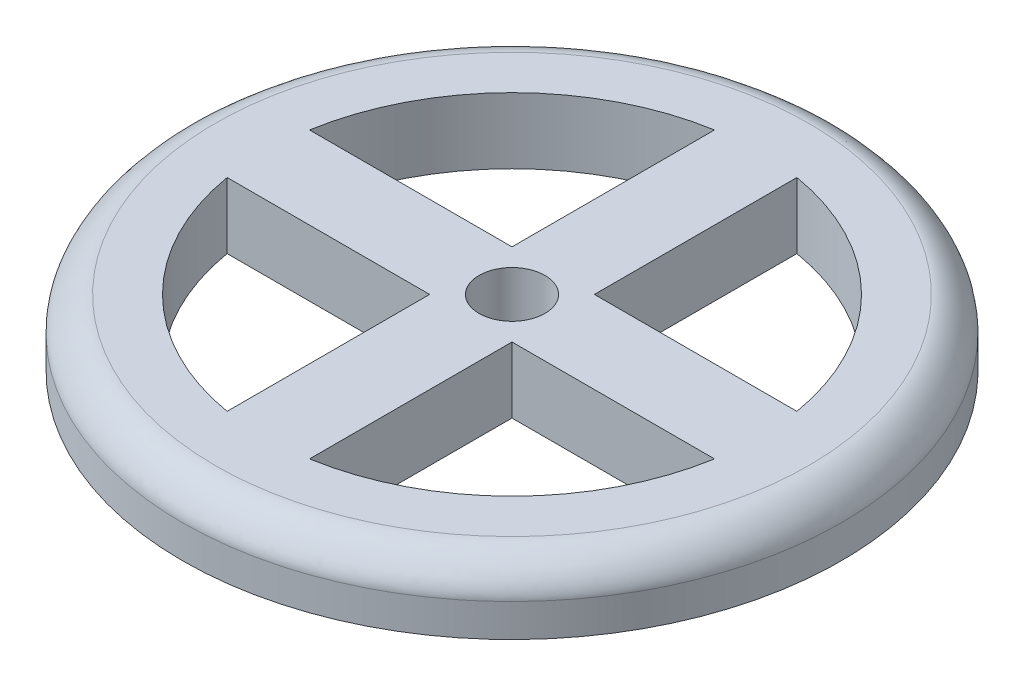
ISO-10303-21;
HEADER;
FILE_DESCRIPTION(('STEP AP214'),'2;1');
FILE_NAME('part.step','',(''),(''),'','','');
FILE_SCHEMA(('AUTOMOTIVE_DESIGN { 1 0 10303 214 1 1 1 1 }'));
ENDSEC;
DATA;
#1=APPLICATION_CONTEXT('core data for automotive mechanical design processes');
#2=APPLICATION_PROTOCOL_DEFINITION('international standard','automotive_design',2000,#1);
#3=PRODUCT_CONTEXT('',#1,'mechanical');
#4=PRODUCT('Part','Part','',(#3));
#5=PRODUCT_RELATED_PRODUCT_CATEGORY('part','',(#4));
#6=PRODUCT_DEFINITION_FORMATION('','',#4);
#7=PRODUCT_DEFINITION_CONTEXT('part definition',#1,'design');
#8=PRODUCT_DEFINITION('design','',#6,#7);
#9=PRODUCT_DEFINITION_SHAPE('','',#8);
#10=(LENGTH_UNIT() NAMED_UNIT(*) SI_UNIT(.MILLI.,.METRE.));
#11=(NAMED_UNIT(*) PLANE_ANGLE_UNIT() SI_UNIT($,.RADIAN.));
#12=(NAMED_UNIT(*) SI_UNIT($,.STERADIAN.) SOLID_ANGLE_UNIT());
#13=UNCERTAINTY_MEASURE_WITH_UNIT(LENGTH_MEASURE(1.E-05),#10,'distance_accuracy_value','');
#14=(GEOMETRIC_REPRESENTATION_CONTEXT(3) GLOBAL_UNCERTAINTY_ASSIGNED_CONTEXT((#13)) GLOBAL_UNIT_ASSIGNED_CONTEXT((#10,
#11,#12)) REPRESENTATION_CONTEXT('',''));
#15=CARTESIAN_POINT('',(0.,0.,0.));
#16=DIRECTION('',(0.,0.,1.));
#17=DIRECTION('',(1.,0.,0.));
#18=AXIS2_PLACEMENT_3D('',#15,#16,#17);
#19=CARTESIAN_POINT('',(-2.5,4.,0.));
#20=DIRECTION('',(1.,0.,0.));
#21=DIRECTION('',(0.,0.,-1.));
#22=AXIS2_PLACEMENT_3D('',#19,#20,#21);
#23=PLANE('',#22);
#24=DIRECTION('',(0.,0.,1.));
#25=VECTOR('',#24,1.);
#26=CARTESIAN_POINT('',(-2.5,0.,0.));
#27=LINE('',#26,#25);
#28=CARTESIAN_POINT('',(-2.5,0.,-14.790199457749));
#29=VERTEX_POINT('',#28);
#30=CARTESIAN_POINT('',(-2.5,0.,-2.5));
#31=VERTEX_POINT('',#30);
#32=EDGE_CURVE('E160',#29,#31,#27,.T.);
#33=ORIENTED_EDGE('',*,*,#32,.T.);
#34=DIRECTION('',(0.,-1.,0.));
#35=VECTOR('',#34,1.);
#36=CARTESIAN_POINT('',(-2.5,4.,-2.5));
#37=LINE('',#36,#35);
#38=CARTESIAN_POINT('',(-2.5,4.,-2.5));
#39=VERTEX_POINT('',#38);
#40=EDGE_CURVE('E159',#39,#31,#37,.T.);
#41=ORIENTED_EDGE('',*,*,#40,.F.);
#42=DIRECTION('',(0.,0.,1.));
#43=VECTOR('',#42,1.);
#44=CARTESIAN_POINT('',(-2.5,4.,0.));
#45=LINE('',#44,#43);
#46=CARTESIAN_POINT('',(-2.5,4.,-14.790199457749));
#47=VERTEX_POINT('',#46);
#48=EDGE_CURVE('E149',#47,#39,#45,.T.);
#49=ORIENTED_EDGE('',*,*,#48,.F.);
#50=DIRECTION('',(0.,-1.,0.));
#51=VECTOR('',#50,1.);
#52=CARTESIAN_POINT('',(-2.5,4.,-14.790199457749));
#53=LINE('',#52,#51);
#54=EDGE_CURVE('E70',#47,#29,#53,.T.);
#55=ORIENTED_EDGE('',*,*,#54,.T.);
#56=EDGE_LOOP('',(#33,#41,#49,#55));
#57=FACE_BOUND('',#56,.T.);
#58=ADVANCED_FACE('F46',(#57),#23,.F.);
#59=CARTESIAN_POINT('',(0.,4.,-2.5));
#60=DIRECTION('',(0.,0.,-1.));
#61=DIRECTION('',(-1.,0.,0.));
#62=AXIS2_PLACEMENT_3D('',#59,#60,#61);
#63=PLANE('',#62);
#64=DIRECTION('',(1.,0.,0.));
#65=VECTOR('',#64,1.);
#66=CARTESIAN_POINT('',(0.,0.,-2.5));
#67=LINE('',#66,#65);
#68=CARTESIAN_POINT('',(-14.790199457749,0.,-2.5));
#69=VERTEX_POINT('',#68);
#70=EDGE_CURVE('E211',#69,#31,#67,.T.);
#71=ORIENTED_EDGE('',*,*,#70,.F.);
#72=DIRECTION('',(0.,-1.,0.));
#73=VECTOR('',#72,1.);
#74=CARTESIAN_POINT('',(-14.790199457749,4.,-2.5));
#75=LINE('',#74,#73);
#76=CARTESIAN_POINT('',(-14.790199457749,4.,-2.5));
#77=VERTEX_POINT('',#76);
#78=EDGE_CURVE('E108',#77,#69,#75,.T.);
#79=ORIENTED_EDGE('',*,*,#78,.F.);
#80=DIRECTION('',(1.,0.,0.));
#81=VECTOR('',#80,1.);
#82=CARTESIAN_POINT('',(0.,4.,-2.5));
#83=LINE('',#82,#81);
#84=EDGE_CURVE('E154',#77,#39,#83,.T.);
#85=ORIENTED_EDGE('',*,*,#84,.T.);
#86=ORIENTED_EDGE('',*,*,#40,.T.);
#87=EDGE_LOOP('',(#71,#79,#85,#86));
#88=FACE_BOUND('',#87,.T.);
#89=ADVANCED_FACE('F165',(#88),#63,.T.);
#90=CARTESIAN_POINT('',(2.5,4.,0.));
#91=DIRECTION('',(1.,0.,0.));
#92=DIRECTION('',(0.,0.,-1.));
#93=AXIS2_PLACEMENT_3D('',#90,#91,#92);
#94=PLANE('',#93);
#95=DIRECTION('',(0.,0.,1.));
#96=VECTOR('',#95,1.);
#97=CARTESIAN_POINT('',(2.5,0.,0.));
#98=LINE('',#97,#96);
#99=CARTESIAN_POINT('',(2.5,0.,2.5));
#100=VERTEX_POINT('',#99);
#101=CARTESIAN_POINT('',(2.5,0.,14.790199457749));
#102=VERTEX_POINT('',#101);
#103=EDGE_CURVE('E200',#100,#102,#98,.T.);
#104=ORIENTED_EDGE('',*,*,#103,.F.);
#105=DIRECTION('',(0.,-1.,0.));
#106=VECTOR('',#105,1.);
#107=CARTESIAN_POINT('',(2.5,4.,2.5));
#108=LINE('',#107,#106);
#109=CARTESIAN_POINT('',(2.5,4.,2.5));
#110=VERTEX_POINT('',#109);
#111=EDGE_CURVE('E225',#110,#100,#108,.T.);
#112=ORIENTED_EDGE('',*,*,#111,.F.);
#113=DIRECTION('',(0.,0.,1.));
#114=VECTOR('',#113,1.);
#115=CARTESIAN_POINT('',(2.5,4.,0.));
#116=LINE('',#115,#114);
#117=CARTESIAN_POINT('',(2.5,4.,14.790199457749));
#118=VERTEX_POINT('',#117);
#119=EDGE_CURVE('E363',#110,#118,#116,.T.);
#120=ORIENTED_EDGE('',*,*,#119,.T.);
#121=DIRECTION('',(0.,-1.,0.));
#122=VECTOR('',#121,1.);
#123=CARTESIAN_POINT('',(2.5,4.,14.790199457749));
#124=LINE('',#123,#122);
#125=EDGE_CURVE('E228',#118,#102,#124,.T.);
#126=ORIENTED_EDGE('',*,*,#125,.T.);
#127=EDGE_LOOP('',(#104,#112,#120,#126));
#128=FACE_BOUND('',#127,.T.);
#129=ADVANCED_FACE('F320',(#128),#94,.T.);
#130=CARTESIAN_POINT('',(0.,4.,2.5));
#131=DIRECTION('',(0.,0.,-1.));
#132=DIRECTION('',(-1.,0.,0.));
#133=AXIS2_PLACEMENT_3D('',#130,#131,#132);
#134=PLANE('',#133);
#135=DIRECTION('',(1.,0.,0.));
#136=VECTOR('',#135,1.);
#137=CARTESIAN_POINT('',(0.,0.,2.5));
#138=LINE('',#137,#136);
#139=CARTESIAN_POINT('',(14.790199457749,0.,2.5));
#140=VERTEX_POINT('',#139);
#141=EDGE_CURVE('E204',#100,#140,#138,.T.);
#142=ORIENTED_EDGE('',*,*,#141,.T.);
#143=DIRECTION('',(0.,-1.,0.));
#144=VECTOR('',#143,1.);
#145=CARTESIAN_POINT('',(14.790199457749,4.,2.5));
#146=LINE('',#145,#144);
#147=CARTESIAN_POINT('',(14.790199457749,4.,2.5));
#148=VERTEX_POINT('',#147);
#149=EDGE_CURVE('E231',#148,#140,#146,.T.);
#150=ORIENTED_EDGE('',*,*,#149,.F.);
#151=DIRECTION('',(1.,0.,0.));
#152=VECTOR('',#151,1.);
#153=CARTESIAN_POINT('',(0.,4.,2.5));
#154=LINE('',#153,#152);
#155=EDGE_CURVE('E369',#110,#148,#154,.T.);
#156=ORIENTED_EDGE('',*,*,#155,.F.);
#157=ORIENTED_EDGE('',*,*,#111,.T.);
#158=EDGE_LOOP('',(#142,#150,#156,#157));
#159=FACE_BOUND('',#158,.T.);
#160=ADVANCED_FACE('F322',(#159),#134,.F.);
#161=CARTESIAN_POINT('',(0.,4.,-2.5));
#162=DIRECTION('',(0.,0.,-1.));
#163=DIRECTION('',(-1.,0.,0.));
#164=AXIS2_PLACEMENT_3D('',#161,#162,#163);
#165=PLANE('',#164);
#166=DIRECTION('',(1.,0.,0.));
#167=VECTOR('',#166,1.);
#168=CARTESIAN_POINT('',(0.,0.,-2.5));
#169=LINE('',#168,#167);
#170=CARTESIAN_POINT('',(2.5,0.,-2.5));
#171=VERTEX_POINT('',#170);
#172=CARTESIAN_POINT('',(14.790199457749,0.,-2.5));
#173=VERTEX_POINT('',#172);
#174=EDGE_CURVE('E190',#171,#173,#169,.T.);
#175=ORIENTED_EDGE('',*,*,#174,.F.);
#176=DIRECTION('',(0.,-1.,0.));
#177=VECTOR('',#176,1.);
#178=CARTESIAN_POINT('',(2.5,4.,-2.5));
#179=LINE('',#178,#177);
#180=CARTESIAN_POINT('',(2.5,4.,-2.5));
#181=VERTEX_POINT('',#180);
#182=EDGE_CURVE('E232',#181,#171,#179,.T.);
#183=ORIENTED_EDGE('',*,*,#182,.F.);
#184=DIRECTION('',(1.,0.,0.));
#185=VECTOR('',#184,1.);
#186=CARTESIAN_POINT('',(0.,4.,-2.5));
#187=LINE('',#186,#185);
#188=CARTESIAN_POINT('',(14.790199457749,4.,-2.5));
#189=VERTEX_POINT('',#188);
#190=EDGE_CURVE('E353',#181,#189,#187,.T.);
#191=ORIENTED_EDGE('',*,*,#190,.T.);
#192=DIRECTION('',(0.,-1.,0.));
#193=VECTOR('',#192,1.);
#194=CARTESIAN_POINT('',(14.790199457749,4.,-2.5));
#195=LINE('',#194,#193);
#196=EDGE_CURVE('E237',#189,#173,#195,.T.);
#197=ORIENTED_EDGE('',*,*,#196,.T.);
#198=EDGE_LOOP('',(#175,#183,#191,#197));
#199=FACE_BOUND('',#198,.T.);
#200=ADVANCED_FACE('F325',(#199),#165,.T.);
#201=CARTESIAN_POINT('',(2.5,4.,0.));
#202=DIRECTION('',(1.,0.,0.));
#203=DIRECTION('',(0.,0.,-1.));
#204=AXIS2_PLACEMENT_3D('',#201,#202,#203);
#205=PLANE('',#204);
#206=DIRECTION('',(0.,0.,1.));
#207=VECTOR('',#206,1.);
#208=CARTESIAN_POINT('',(2.5,0.,0.));
#209=LINE('',#208,#207);
#210=CARTESIAN_POINT('',(2.5,0.,-14.790199457749));
#211=VERTEX_POINT('',#210);
#212=EDGE_CURVE('E196',#211,#171,#209,.T.);
#213=ORIENTED_EDGE('',*,*,#212,.F.);
#214=DIRECTION('',(0.,-1.,0.));
#215=VECTOR('',#214,1.);
#216=CARTESIAN_POINT('',(2.5,4.,-14.790199457749));
#217=LINE('',#216,#215);
#218=CARTESIAN_POINT('',(2.5,4.,-14.790199457749));
#219=VERTEX_POINT('',#218);
#220=EDGE_CURVE('E240',#219,#211,#217,.T.);
#221=ORIENTED_EDGE('',*,*,#220,.F.);
#222=DIRECTION('',(0.,0.,1.));
#223=VECTOR('',#222,1.);
#224=CARTESIAN_POINT('',(2.5,4.,0.));
#225=LINE('',#224,#223);
#226=EDGE_CURVE('E358',#219,#181,#225,.T.);
#227=ORIENTED_EDGE('',*,*,#226,.T.);
#228=ORIENTED_EDGE('',*,*,#182,.T.);
#229=EDGE_LOOP('',(#213,#221,#227,#228));
#230=FACE_BOUND('',#229,.T.);
#231=ADVANCED_FACE('F330',(#230),#205,.T.);
#232=CARTESIAN_POINT('',(0.,4.,2.5));
#233=DIRECTION('',(0.,0.,-1.));
#234=DIRECTION('',(-1.,0.,0.));
#235=AXIS2_PLACEMENT_3D('',#232,#233,#234);
#236=PLANE('',#235);
#237=DIRECTION('',(1.,0.,0.));
#238=VECTOR('',#237,1.);
#239=CARTESIAN_POINT('',(0.,0.,2.5));
#240=LINE('',#239,#238);
#241=CARTESIAN_POINT('',(-14.790199457749,0.,2.5));
#242=VERTEX_POINT('',#241);
#243=CARTESIAN_POINT('',(-2.5,0.,2.5));
#244=VERTEX_POINT('',#243);
#245=EDGE_CURVE('E178',#242,#244,#240,.T.);
#246=ORIENTED_EDGE('',*,*,#245,.T.);
#247=DIRECTION('',(0.,-1.,0.));
#248=VECTOR('',#247,1.);
#249=CARTESIAN_POINT('',(-2.5,4.,2.5));
#250=LINE('',#249,#248);
#251=CARTESIAN_POINT('',(-2.5,4.,2.5));
#252=VERTEX_POINT('',#251);
#253=EDGE_CURVE('E241',#252,#244,#250,.T.);
#254=ORIENTED_EDGE('',*,*,#253,.F.);
#255=DIRECTION('',(1.,0.,0.));
#256=VECTOR('',#255,1.);
#257=CARTESIAN_POINT('',(0.,4.,2.5));
#258=LINE('',#257,#256);
#259=CARTESIAN_POINT('',(-14.790199457749,4.,2.5));
#260=VERTEX_POINT('',#259);
#261=EDGE_CURVE('E222',#260,#252,#258,.T.);
#262=ORIENTED_EDGE('',*,*,#261,.F.);
#263=DIRECTION('',(0.,-1.,0.));
#264=VECTOR('',#263,1.);
#265=CARTESIAN_POINT('',(-14.790199457749,4.,2.5));
#266=LINE('',#265,#264);
#267=EDGE_CURVE('E177',#260,#242,#266,.T.);
#268=ORIENTED_EDGE('',*,*,#267,.T.);
#269=EDGE_LOOP('',(#246,#254,#262,#268));
#270=FACE_BOUND('',#269,.T.);
#271=ADVANCED_FACE('F333',(#270),#236,.F.);
#272=CARTESIAN_POINT('',(-2.5,4.,0.));
#273=DIRECTION('',(1.,0.,0.));
#274=DIRECTION('',(0.,0.,-1.));
#275=AXIS2_PLACEMENT_3D('',#272,#273,#274);
#276=PLANE('',#275);
#277=DIRECTION('',(0.,0.,1.));
#278=VECTOR('',#277,1.);
#279=CARTESIAN_POINT('',(-2.5,0.,0.));
#280=LINE('',#279,#278);
#281=CARTESIAN_POINT('',(-2.5,0.,14.790199457749));
#282=VERTEX_POINT('',#281);
#283=EDGE_CURVE('E182',#244,#282,#280,.T.);
#284=ORIENTED_EDGE('',*,*,#283,.T.);
#285=DIRECTION('',(0.,-1.,0.));
#286=VECTOR('',#285,1.);
#287=CARTESIAN_POINT('',(-2.5,4.,14.790199457749));
#288=LINE('',#287,#286);
#289=CARTESIAN_POINT('',(-2.5,4.,14.790199457749));
#290=VERTEX_POINT('',#289);
#291=EDGE_CURVE('E248',#290,#282,#288,.T.);
#292=ORIENTED_EDGE('',*,*,#291,.F.);
#293=DIRECTION('',(0.,0.,1.));
#294=VECTOR('',#293,1.);
#295=CARTESIAN_POINT('',(-2.5,4.,0.));
#296=LINE('',#295,#294);
#297=EDGE_CURVE('E121',#252,#290,#296,.T.);
#298=ORIENTED_EDGE('',*,*,#297,.F.);
#299=ORIENTED_EDGE('',*,*,#253,.T.);
#300=EDGE_LOOP('',(#284,#292,#298,#299));
#301=FACE_BOUND('',#300,.T.);
#302=ADVANCED_FACE('F284',(#301),#276,.F.);
#303=CARTESIAN_POINT('',(0.,4.,0.));
#304=DIRECTION('',(0.,-1.,0.));
#305=DIRECTION('',(0.,0.,-1.));
#306=AXIS2_PLACEMENT_3D('',#303,#304,#305);
#307=CYLINDRICAL_SURFACE('',#306,20.);
#308=CARTESIAN_POINT('',(0.,2.,20.));
#309=CARTESIAN_POINT('',(1.30899693832957,2.,20.));
#310=CARTESIAN_POINT('',(2.61796151112264,2.,19.8710782422801));
#311=CARTESIAN_POINT('',(5.1856513695225,2.,19.3603329738491));
#312=CARTESIAN_POINT('',(6.44431316786531,2.,18.9785220915386));
#313=CARTESIAN_POINT('',(8.86302412673829,2.,17.9766592089129));
#314=CARTESIAN_POINT('',(10.0230134835804,2.,17.3566319800963));
#315=CARTESIAN_POINT('',(12.1997958372037,2.,15.9021525120055));
#316=CARTESIAN_POINT('',(13.2165350120906,2.,15.0677362353713));
#317=CARTESIAN_POINT('',(15.0677362353713,2.,13.2165350120906));
#318=CARTESIAN_POINT('',(15.9021525120058,2.,12.1997958372032));
#319=CARTESIAN_POINT('',(17.356631980096,2.,10.0230134835808));
#320=CARTESIAN_POINT('',(17.9766592089129,2.,8.86302412673833));
#321=CARTESIAN_POINT('',(18.9785220915386,2.,6.44431316786525));
#322=CARTESIAN_POINT('',(19.3603329738492,2.,5.18565136952208));
#323=CARTESIAN_POINT('',(19.87107824228,2.,2.61796151112308));
#324=CARTESIAN_POINT('',(20.,2.,1.3089969383224));
#325=CARTESIAN_POINT('',(20.,2.,-1.30899693832239));
#326=CARTESIAN_POINT('',(19.87107824228,2.,-2.6179615111233));
#327=CARTESIAN_POINT('',(19.3603329738492,2.,-5.1856513695218));
#328=CARTESIAN_POINT('',(18.9785220915382,2.,-6.44431316786614));
#329=CARTESIAN_POINT('',(17.9766592089133,2.,-8.86302412673747));
#330=CARTESIAN_POINT('',(17.3566319800964,2.,-10.0230134835803));
#331=CARTESIAN_POINT('',(15.9021525120055,2.,-12.1997958372038));
#332=CARTESIAN_POINT('',(15.0677362353716,2.,-13.2165350120903));
#333=CARTESIAN_POINT('',(13.2165350120902,2.,-15.0677362353717));
#334=CARTESIAN_POINT('',(12.1997958372047,2.,-15.9021525120048));
#335=CARTESIAN_POINT('',(10.0230134835794,2.,-17.356631980097));
#336=CARTESIAN_POINT('',(8.86302412673793,2.,-17.9766592089131));
#337=CARTESIAN_POINT('',(6.44431316786572,2.,-18.9785220915384));
#338=CARTESIAN_POINT('',(5.18565136952208,2.,-19.3603329738492));
#339=CARTESIAN_POINT('',(2.61796151112308,2.,-19.87107824228));
#340=CARTESIAN_POINT('',(1.3089969383224,2.,-20.));
#341=CARTESIAN_POINT('',(-1.30899693832239,2.,-20.));
#342=CARTESIAN_POINT('',(-2.61796151112281,2.,-19.8710782422801));
#343=CARTESIAN_POINT('',(-5.18565136952229,2.,-19.3603329738491));
#344=CARTESIAN_POINT('',(-6.44431316786566,2.,-18.9785220915384));
#345=CARTESIAN_POINT('',(-8.86302412673787,2.,-17.9766592089131));
#346=CARTESIAN_POINT('',(-10.0230134835794,2.,-17.356631980097));
#347=CARTESIAN_POINT('',(-12.1997958372047,2.,-15.9021525120048));
#348=CARTESIAN_POINT('',(-13.2165350120908,2.,-15.0677362353711));
#349=CARTESIAN_POINT('',(-15.0677362353711,2.,-13.2165350120908));
#350=CARTESIAN_POINT('',(-15.9021525120056,2.,-12.1997958372036));
#351=CARTESIAN_POINT('',(-17.3566319800962,2.,-10.0230134835806));
#352=CARTESIAN_POINT('',(-17.9766592089133,2.,-8.86302412673727));
#353=CARTESIAN_POINT('',(-18.9785220915381,2.,-6.44431316786638));
#354=CARTESIAN_POINT('',(-19.3603329738492,2.,-5.18565136952166));
#355=CARTESIAN_POINT('',(-19.87107824228,2.,-2.61796151112353));
#356=CARTESIAN_POINT('',(-20.,2.,-1.30899693832236));
#357=CARTESIAN_POINT('',(-20.,2.,1.30899693832243));
#358=CARTESIAN_POINT('',(-19.8710782422801,2.,2.61796151112285));
#359=CARTESIAN_POINT('',(-19.3603329738491,2.,5.18565136952225));
#360=CARTESIAN_POINT('',(-18.9785220915381,2.,6.44431316786632));
#361=CARTESIAN_POINT('',(-17.9766592089134,2.,8.86302412673721));
#362=CARTESIAN_POINT('',(-17.3566319800967,2.,10.0230134835798));
#363=CARTESIAN_POINT('',(-15.9021525120051,2.,12.1997958372042));
#364=CARTESIAN_POINT('',(-15.0677362353709,2.,13.216535012091));
#365=CARTESIAN_POINT('',(-13.2165350120911,2.,15.0677362353708));
#366=CARTESIAN_POINT('',(-12.199795837205,2.,15.9021525120047));
#367=CARTESIAN_POINT('',(-10.0230134835791,2.,17.3566319800971));
#368=CARTESIAN_POINT('',(-8.86302412673799,2.,17.976659208913));
#369=CARTESIAN_POINT('',(-6.44431316786566,2.,18.9785220915384));
#370=CARTESIAN_POINT('',(-5.18565136952176,2.,19.3603329738492));
#371=CARTESIAN_POINT('',(-2.61796151112343,2.,19.87107824228));
#372=CARTESIAN_POINT('',(-1.30899693832957,2.,20.));
#373=CARTESIAN_POINT('',(0.,2.,20.));
#374=(BOUNDED_CURVE() B_SPLINE_CURVE(3,(#308,#309,#310,#311,#312,#313,#314,#315,#316,#317,#318,
#319,#320,#321,#322,#323,#324,#325,#326,#327,#328,#329,#330,#331,#332,#333,#334,#335,#336,#337,
#338,#339,#340,#341,#342,#343,#344,#345,#346,#347,#348,#349,#350,#351,#352,#353,#354,#355,#356,
#357,#358,#359,#360,#361,#362,#363,#364,#365,#366,#367,#368,#369,#370,#371,#372,#373),
.UNSPECIFIED.,.T.,.F.) B_SPLINE_CURVE_WITH_KNOTS((4,2,2,2,2,2,2,2,2,2,2,2,2,2,2,2,2,2,2,2,2,2,2,
2,2,2,2,2,2,2,2,2,4),(0.,0.196349540849362,0.392699081698724,0.589048622548086,
0.785398163397448,0.98174770424681,1.17809724509617,1.37444678594553,1.5707963267949,
1.76714586764426,1.96349540849362,2.15984494934298,2.35619449019234,2.55254403104171,
2.74889357189107,2.94524311274043,3.14159265358979,3.33794219443916,3.53429173528852,
3.73064127613788,3.92699081698724,4.1233403578366,4.31968989868597,4.51603943953533,
4.71238898038469,4.90873852123405,5.10508806208341,5.30143760293278,5.49778714378214,
5.6941366846315,5.89048622548086,6.08683576633022,6.28318530717959),
.UNSPECIFIED.) CURVE() GEOMETRIC_REPRESENTATION_ITEM() RATIONAL_B_SPLINE_CURVE((1.,1.,1.,1.,1.,
1.,1.,1.,1.,1.,1.,1.,1.,1.,1.,1.,1.,1.,1.,1.,1.,1.,1.,1.,1.,1.,1.,1.,1.,1.,1.,1.,1.,1.,1.,1.,1.,
1.,1.,1.,1.,1.,1.,1.,1.,1.,1.,1.,1.,1.,1.,1.,1.,1.,1.,1.,1.,1.,1.,1.,1.,1.,1.,1.,1.,1.)) REPRESENTATION_ITEM(''));
#375=CARTESIAN_POINT('',(0.,2.,20.));
#376=VERTEX_POINT('',#375);
#377=EDGE_CURVE('E12',#376,#376,#374,.F.);
#378=ORIENTED_EDGE('',*,*,#377,.T.);
#379=EDGE_LOOP('',(#378));
#380=FACE_BOUND('',#379,.T.);
#381=CARTESIAN_POINT('',(0.,0.,0.));
#382=DIRECTION('',(0.,1.,0.));
#383=DIRECTION('',(0.,0.,1.));
#384=AXIS2_PLACEMENT_3D('',#381,#382,#383);
#385=CIRCLE('',#384,20.);
#386=CARTESIAN_POINT('',(0.,0.,20.));
#387=VERTEX_POINT('',#386);
#388=EDGE_CURVE('E214',#387,#387,#385,.T.);
#389=ORIENTED_EDGE('',*,*,#388,.T.);
#390=EDGE_LOOP('',(#389));
#391=FACE_BOUND('',#390,.T.);
#392=ADVANCED_FACE('F279',(#380,#391),#307,.T.);
#393=CARTESIAN_POINT('',(0.,4.,0.));
#394=DIRECTION('',(0.,-1.,0.));
#395=DIRECTION('',(0.,0.,-1.));
#396=AXIS2_PLACEMENT_3D('',#393,#394,#395);
#397=CYLINDRICAL_SURFACE('',#396,15.);
#398=CARTESIAN_POINT('',(0.,0.,0.));
#399=DIRECTION('',(0.,1.,0.));
#400=DIRECTION('',(0.,0.,1.));
#401=AXIS2_PLACEMENT_3D('',#398,#399,#400);
#402=CIRCLE('',#401,15.);
#403=EDGE_CURVE('E191',#29,#69,#402,.T.);
#404=ORIENTED_EDGE('',*,*,#403,.F.);
#405=ORIENTED_EDGE('',*,*,#54,.F.);
#406=CARTESIAN_POINT('',(0.,4.,0.));
#407=DIRECTION('',(0.,1.,0.));
#408=DIRECTION('',(0.,0.,1.));
#409=AXIS2_PLACEMENT_3D('',#406,#407,#408);
#410=CIRCLE('',#409,15.);
#411=EDGE_CURVE('E155',#47,#77,#410,.T.);
#412=ORIENTED_EDGE('',*,*,#411,.T.);
#413=ORIENTED_EDGE('',*,*,#78,.T.);
#414=EDGE_LOOP('',(#404,#405,#412,#413));
#415=FACE_BOUND('',#414,.T.);
#416=ADVANCED_FACE('F283',(#415),#397,.F.);
#417=EDGE_CURVE('E208',#102,#140,#402,.T.);
#418=ORIENTED_EDGE('',*,*,#417,.F.);
#419=ORIENTED_EDGE('',*,*,#125,.F.);
#420=EDGE_CURVE('E157',#118,#148,#410,.T.);
#421=ORIENTED_EDGE('',*,*,#420,.T.);
#422=ORIENTED_EDGE('',*,*,#149,.T.);
#423=EDGE_LOOP('',(#418,#419,#421,#422));
#424=FACE_BOUND('',#423,.T.);
#425=ADVANCED_FACE('F385',(#424),#397,.F.);
#426=EDGE_CURVE('E192',#173,#211,#402,.T.);
#427=ORIENTED_EDGE('',*,*,#426,.F.);
#428=ORIENTED_EDGE('',*,*,#196,.F.);
#429=EDGE_CURVE('E354',#189,#219,#410,.T.);
#430=ORIENTED_EDGE('',*,*,#429,.T.);
#431=ORIENTED_EDGE('',*,*,#220,.T.);
#432=EDGE_LOOP('',(#427,#428,#430,#431));
#433=FACE_BOUND('',#432,.T.);
#434=ADVANCED_FACE('F397',(#433),#397,.F.);
#435=EDGE_CURVE('E186',#242,#282,#402,.T.);
#436=ORIENTED_EDGE('',*,*,#435,.F.);
#437=ORIENTED_EDGE('',*,*,#267,.F.);
#438=EDGE_CURVE('E171',#260,#290,#410,.T.);
#439=ORIENTED_EDGE('',*,*,#438,.T.);
#440=ORIENTED_EDGE('',*,*,#291,.T.);
#441=EDGE_LOOP('',(#436,#437,#439,#440));
#442=FACE_BOUND('',#441,.T.);
#443=ADVANCED_FACE('F277',(#442),#397,.F.);
#444=CARTESIAN_POINT('',(0.,4.,0.));
#445=DIRECTION('',(0.,-1.,0.));
#446=DIRECTION('',(0.,0.,-1.));
#447=AXIS2_PLACEMENT_3D('',#444,#445,#446);
#448=CYLINDRICAL_SURFACE('',#447,2.);
#449=CARTESIAN_POINT('',(0.,4.,0.));
#450=DIRECTION('',(0.,1.,0.));
#451=DIRECTION('',(0.,0.,1.));
#452=AXIS2_PLACEMENT_3D('',#449,#450,#451);
#453=CIRCLE('',#452,2.);
#454=CARTESIAN_POINT('',(0.,4.,2.));
#455=VERTEX_POINT('',#454);
#456=EDGE_CURVE('E169',#455,#455,#453,.T.);
#457=ORIENTED_EDGE('',*,*,#456,.T.);
#458=EDGE_LOOP('',(#457));
#459=FACE_BOUND('',#458,.T.);
#460=CARTESIAN_POINT('',(0.,0.,0.));
#461=DIRECTION('',(0.,1.,0.));
#462=DIRECTION('',(0.,0.,1.));
#463=AXIS2_PLACEMENT_3D('',#460,#461,#462);
#464=CIRCLE('',#463,2.);
#465=CARTESIAN_POINT('',(0.,0.,2.));
#466=VERTEX_POINT('',#465);
#467=EDGE_CURVE('E218',#466,#466,#464,.T.);
#468=ORIENTED_EDGE('',*,*,#467,.F.);
#469=EDGE_LOOP('',(#468));
#470=FACE_BOUND('',#469,.T.);
#471=ADVANCED_FACE('F271',(#459,#470),#448,.F.);
#472=CARTESIAN_POINT('',(0.,4.,0.));
#473=DIRECTION('',(0.,1.,0.));
#474=DIRECTION('',(0.,0.,1.));
#475=AXIS2_PLACEMENT_3D('',#472,#473,#474);
#476=PLANE('',#475);
#477=CARTESIAN_POINT('',(0.,4.,18.));
#478=CARTESIAN_POINT('',(-1.17809724449661,4.,18.));
#479=CARTESIAN_POINT('',(-2.3561653600105,4.,17.8839704180491));
#480=CARTESIAN_POINT('',(-4.66708623257016,4.,17.4242996764672));
#481=CARTESIAN_POINT('',(-5.79988185107918,4.,17.0806698823861));
#482=CARTESIAN_POINT('',(-7.9767217140641,4.,16.1789932880202));
#483=CARTESIAN_POINT('',(-9.02071213522079,4.,15.6209687820875));
#484=CARTESIAN_POINT('',(-10.9798162534849,4.,14.3119372608041));
#485=CARTESIAN_POINT('',(-11.894881510882,4.,13.5609626118337));
#486=CARTESIAN_POINT('',(-13.5609626118338,4.,11.8948815108819));
#487=CARTESIAN_POINT('',(-14.3119372608041,4.,10.9798162534839));
#488=CARTESIAN_POINT('',(-15.6209687820875,4.,9.02071213522179));
#489=CARTESIAN_POINT('',(-16.1789932880222,4.,7.97672171406405));
#490=CARTESIAN_POINT('',(-17.0806698823841,4.,5.79988185107913));
#491=CARTESIAN_POINT('',(-17.4242996764651,4.,4.66708623256987));
#492=CARTESIAN_POINT('',(-17.8839704180512,4.,2.35616536001072));
#493=CARTESIAN_POINT('',(-18.,4.,1.17809724449019));
#494=CARTESIAN_POINT('',(-18.,4.,-1.17809724449013));
#495=CARTESIAN_POINT('',(-17.8839704180512,4.,-2.35616536001076));
#496=CARTESIAN_POINT('',(-17.4242996764651,4.,-4.66708623256991));
#497=CARTESIAN_POINT('',(-17.0806698823841,4.,-5.79988185107918));
#498=CARTESIAN_POINT('',(-16.1789932880222,4.,-7.9767217140641));
#499=CARTESIAN_POINT('',(-15.6209687820875,4.,-9.02071213522284));
#500=CARTESIAN_POINT('',(-14.3119372608041,4.,-10.9798162534829));
#501=CARTESIAN_POINT('',(-13.5609626118353,4.,-11.8948815108825));
#502=CARTESIAN_POINT('',(-11.8948815108804,4.,-13.5609626118332));
#503=CARTESIAN_POINT('',(-10.9798162534835,4.,-14.311937260804));
#504=CARTESIAN_POINT('',(-9.02071213522213,4.,-15.6209687820877));
#505=CARTESIAN_POINT('',(-7.97672171406407,4.,-16.1789932880207));
#506=CARTESIAN_POINT('',(-5.79988185107912,4.,-17.0806698823857));
#507=CARTESIAN_POINT('',(-4.66708623256991,4.,-17.4242996764653));
#508=CARTESIAN_POINT('',(-2.35616536001068,4.,-17.883970418051));
#509=CARTESIAN_POINT('',(-1.17809724449015,4.,-18.));
#510=CARTESIAN_POINT('',(1.17809724449016,4.,-18.));
#511=CARTESIAN_POINT('',(2.35616536001071,4.,-17.883970418053));
#512=CARTESIAN_POINT('',(4.66708623256993,4.,-17.4242996764633));
#513=CARTESIAN_POINT('',(5.79988185107917,4.,-17.0806698823856));
#514=CARTESIAN_POINT('',(7.97672171406412,4.,-16.1789932880207));
#515=CARTESIAN_POINT('',(9.02071213522215,4.,-15.6209687820876));
#516=CARTESIAN_POINT('',(10.9798162534836,4.,-14.311937260804));
#517=CARTESIAN_POINT('',(11.8948815108814,4.,-13.5609626118343));
#518=CARTESIAN_POINT('',(13.5609626118343,4.,-11.8948815108814));
#519=CARTESIAN_POINT('',(14.311937260805,4.,-10.9798162534835));
#520=CARTESIAN_POINT('',(15.6209687820866,4.,-9.02071213522213));
#521=CARTESIAN_POINT('',(16.1789932880227,4.,-7.97672171406359));
#522=CARTESIAN_POINT('',(17.0806698823836,4.,-5.79988185107966));
#523=CARTESIAN_POINT('',(17.4242996764653,4.,-4.66708623256965));
#524=CARTESIAN_POINT('',(17.883970418051,4.,-2.35616536001094));
#525=CARTESIAN_POINT('',(18.,4.,-1.17809724449015));
#526=CARTESIAN_POINT('',(18.,4.,1.17809724449016));
#527=CARTESIAN_POINT('',(17.883970418053,4.,2.35616536001096));
#528=CARTESIAN_POINT('',(17.4242996764633,4.,4.66708623256968));
#529=CARTESIAN_POINT('',(17.0806698823836,4.,5.79988185107913));
#530=CARTESIAN_POINT('',(16.1789932880227,4.,7.97672171406409));
#531=CARTESIAN_POINT('',(15.6209687820863,4.,9.02071213522308));
#532=CARTESIAN_POINT('',(14.3119372608053,4.,10.9798162534826));
#533=CARTESIAN_POINT('',(13.5609626118336,4.,11.8948815108811));
#534=CARTESIAN_POINT('',(11.8948815108821,4.,13.5609626118347));
#535=CARTESIAN_POINT('',(10.9798162534836,4.,14.3119372608053));
#536=CARTESIAN_POINT('',(9.02071213522206,4.,15.6209687820863));
#537=CARTESIAN_POINT('',(7.97672171406403,4.,16.1789932880211));
#538=CARTESIAN_POINT('',(5.79988185107921,4.,17.0806698823852));
#539=CARTESIAN_POINT('',(4.66708623256998,4.,17.4242996764636));
#540=CARTESIAN_POINT('',(2.35616536001064,4.,17.8839704180527));
#541=CARTESIAN_POINT('',(1.17809724449661,4.,18.));
#542=CARTESIAN_POINT('',(0.,4.,18.));
#543=(BOUNDED_CURVE() B_SPLINE_CURVE(3,(#477,#478,#479,#480,#481,#482,#483,#484,#485,#486,#487,
#488,#489,#490,#491,#492,#493,#494,#495,#496,#497,#498,#499,#500,#501,#502,#503,#504,#505,#506,
#507,#508,#509,#510,#511,#512,#513,#514,#515,#516,#517,#518,#519,#520,#521,#522,#523,#524,#525,
#526,#527,#528,#529,#530,#531,#532,#533,#534,#535,#536,#537,#538,#539,#540,#541,#542),
.UNSPECIFIED.,.T.,.F.) B_SPLINE_CURVE_WITH_KNOTS((4,2,2,2,2,2,2,2,2,2,2,2,2,2,2,2,2,2,2,2,2,2,2,
2,2,2,2,2,2,2,2,2,4),(0.,0.196349540849362,0.392699081698725,0.589048622548086,
0.785398163397448,0.981747704246811,1.17809724509617,1.37444678594553,1.5707963267949,
1.76714586764426,1.96349540849362,2.15984494934298,2.35619449019234,2.55254403104171,
2.74889357189107,2.94524311274043,3.14159265358979,3.33794219443916,3.53429173528852,
3.73064127613788,3.92699081698724,4.1233403578366,4.31968989868597,4.51603943953533,
4.71238898038469,4.90873852123405,5.10508806208341,5.30143760293278,5.49778714378214,
5.6941366846315,5.89048622548086,6.08683576633022,6.28318530717959),
.UNSPECIFIED.) CURVE() GEOMETRIC_REPRESENTATION_ITEM() RATIONAL_B_SPLINE_CURVE((1.,1.,1.,1.,1.,
1.,1.,1.,1.,1.,1.,1.,1.,1.,1.,1.,1.,1.,1.,1.,1.,1.,1.,1.,1.,1.,1.,1.,1.,1.,1.,1.,1.,1.,1.,1.,1.,
1.,1.,1.,1.,1.,1.,1.,1.,1.,1.,1.,1.,1.,1.,1.,1.,1.,1.,1.,1.,1.,1.,1.,1.,1.,1.,1.,1.,1.)) REPRESENTATION_ITEM(''));
#544=CARTESIAN_POINT('',(0.,4.,18.));
#545=VERTEX_POINT('',#544);
#546=EDGE_CURVE('E62',#545,#545,#543,.F.);
#547=ORIENTED_EDGE('',*,*,#546,.T.);
#548=EDGE_LOOP('',(#547));
#549=FACE_BOUND('',#548,.T.);
#550=ORIENTED_EDGE('',*,*,#261,.T.);
#551=ORIENTED_EDGE('',*,*,#297,.T.);
#552=ORIENTED_EDGE('',*,*,#438,.F.);
#553=EDGE_LOOP('',(#550,#551,#552));
#554=FACE_BOUND('',#553,.T.);
#555=ORIENTED_EDGE('',*,*,#190,.F.);
#556=ORIENTED_EDGE('',*,*,#226,.F.);
#557=ORIENTED_EDGE('',*,*,#429,.F.);
#558=EDGE_LOOP('',(#555,#556,#557));
#559=FACE_BOUND('',#558,.T.);
#560=ORIENTED_EDGE('',*,*,#119,.F.);
#561=ORIENTED_EDGE('',*,*,#155,.T.);
#562=ORIENTED_EDGE('',*,*,#420,.F.);
#563=EDGE_LOOP('',(#560,#561,#562));
#564=FACE_BOUND('',#563,.T.);
#565=ORIENTED_EDGE('',*,*,#48,.T.);
#566=ORIENTED_EDGE('',*,*,#84,.F.);
#567=ORIENTED_EDGE('',*,*,#411,.F.);
#568=EDGE_LOOP('',(#565,#566,#567));
#569=FACE_BOUND('',#568,.T.);
#570=ORIENTED_EDGE('',*,*,#456,.F.);
#571=EDGE_LOOP('',(#570));
#572=FACE_BOUND('',#571,.T.);
#573=ADVANCED_FACE('F151',(#549,#554,#559,#564,#569,#572),#476,.T.);
#574=CARTESIAN_POINT('',(0.,0.,0.));
#575=DIRECTION('',(0.,1.,0.));
#576=DIRECTION('',(0.,0.,1.));
#577=AXIS2_PLACEMENT_3D('',#574,#575,#576);
#578=PLANE('',#577);
#579=ORIENTED_EDGE('',*,*,#245,.F.);
#580=ORIENTED_EDGE('',*,*,#435,.T.);
#581=ORIENTED_EDGE('',*,*,#283,.F.);
#582=EDGE_LOOP('',(#579,#580,#581));
#583=FACE_BOUND('',#582,.T.);
#584=ORIENTED_EDGE('',*,*,#174,.T.);
#585=ORIENTED_EDGE('',*,*,#426,.T.);
#586=ORIENTED_EDGE('',*,*,#212,.T.);
#587=EDGE_LOOP('',(#584,#585,#586));
#588=FACE_BOUND('',#587,.T.);
#589=ORIENTED_EDGE('',*,*,#103,.T.);
#590=ORIENTED_EDGE('',*,*,#417,.T.);
#591=ORIENTED_EDGE('',*,*,#141,.F.);
#592=EDGE_LOOP('',(#589,#590,#591));
#593=FACE_BOUND('',#592,.T.);
#594=ORIENTED_EDGE('',*,*,#32,.F.);
#595=ORIENTED_EDGE('',*,*,#403,.T.);
#596=ORIENTED_EDGE('',*,*,#70,.T.);
#597=EDGE_LOOP('',(#594,#595,#596));
#598=FACE_BOUND('',#597,.T.);
#599=ORIENTED_EDGE('',*,*,#388,.F.);
#600=EDGE_LOOP('',(#599));
#601=FACE_BOUND('',#600,.T.);
#602=ORIENTED_EDGE('',*,*,#467,.T.);
#603=EDGE_LOOP('',(#602));
#604=FACE_BOUND('',#603,.T.);
#605=ADVANCED_FACE('F270',(#583,#588,#593,#598,#601,#604),#578,.F.);
#606=CARTESIAN_POINT('',(0.,4.,18.));
#607=CARTESIAN_POINT('',(1.17809724449661,4.,18.));
#608=CARTESIAN_POINT('',(2.35616536001064,4.,17.8839704180527));
#609=CARTESIAN_POINT('',(4.66708623256998,4.,17.4242996764636));
#610=CARTESIAN_POINT('',(5.79988185107921,4.,17.0806698823852));
#611=CARTESIAN_POINT('',(7.97672171406403,4.,16.1789932880211));
#612=CARTESIAN_POINT('',(9.02071213522206,4.,15.6209687820863));
#613=CARTESIAN_POINT('',(10.9798162534836,4.,14.3119372608053));
#614=CARTESIAN_POINT('',(11.8948815108821,4.,13.5609626118347));
#615=CARTESIAN_POINT('',(13.5609626118336,4.,11.8948815108811));
#616=CARTESIAN_POINT('',(14.3119372608053,4.,10.9798162534826));
#617=CARTESIAN_POINT('',(15.6209687820863,4.,9.02071213522308));
#618=CARTESIAN_POINT('',(16.1789932880227,4.,7.97672171406409));
#619=CARTESIAN_POINT('',(17.0806698823836,4.,5.79988185107913));
#620=CARTESIAN_POINT('',(17.4242996764633,4.,4.66708623256968));
#621=CARTESIAN_POINT('',(17.883970418053,4.,2.35616536001096));
#622=CARTESIAN_POINT('',(18.,4.,1.17809724449016));
#623=CARTESIAN_POINT('',(18.,4.,-1.17809724449015));
#624=CARTESIAN_POINT('',(17.883970418051,4.,-2.35616536001094));
#625=CARTESIAN_POINT('',(17.4242996764653,4.,-4.66708623256965));
#626=CARTESIAN_POINT('',(17.0806698823836,4.,-5.79988185107966));
#627=CARTESIAN_POINT('',(16.1789932880227,4.,-7.97672171406359));
#628=CARTESIAN_POINT('',(15.6209687820866,4.,-9.02071213522213));
#629=CARTESIAN_POINT('',(14.311937260805,4.,-10.9798162534835));
#630=CARTESIAN_POINT('',(13.5609626118343,4.,-11.8948815108814));
#631=CARTESIAN_POINT('',(11.8948815108814,4.,-13.5609626118343));
#632=CARTESIAN_POINT('',(10.9798162534836,4.,-14.311937260804));
#633=CARTESIAN_POINT('',(9.02071213522215,4.,-15.6209687820876));
#634=CARTESIAN_POINT('',(7.97672171406412,4.,-16.1789932880207));
#635=CARTESIAN_POINT('',(5.79988185107917,4.,-17.0806698823856));
#636=CARTESIAN_POINT('',(4.66708623256993,4.,-17.4242996764633));
#637=CARTESIAN_POINT('',(2.35616536001071,4.,-17.883970418053));
#638=CARTESIAN_POINT('',(1.17809724449016,4.,-18.));
#639=CARTESIAN_POINT('',(-1.17809724449015,4.,-18.));
#640=CARTESIAN_POINT('',(-2.35616536001068,4.,-17.883970418051));
#641=CARTESIAN_POINT('',(-4.66708623256991,4.,-17.4242996764653));
#642=CARTESIAN_POINT('',(-5.79988185107912,4.,-17.0806698823857));
#643=CARTESIAN_POINT('',(-7.97672171406407,4.,-16.1789932880207));
#644=CARTESIAN_POINT('',(-9.02071213522213,4.,-15.6209687820877));
#645=CARTESIAN_POINT('',(-10.9798162534835,4.,-14.311937260804));
#646=CARTESIAN_POINT('',(-11.8948815108804,4.,-13.5609626118332));
#647=CARTESIAN_POINT('',(-13.5609626118353,4.,-11.8948815108825));
#648=CARTESIAN_POINT('',(-14.3119372608041,4.,-10.9798162534829));
#649=CARTESIAN_POINT('',(-15.6209687820875,4.,-9.02071213522284));
#650=CARTESIAN_POINT('',(-16.1789932880222,4.,-7.9767217140641));
#651=CARTESIAN_POINT('',(-17.0806698823841,4.,-5.79988185107918));
#652=CARTESIAN_POINT('',(-17.4242996764651,4.,-4.66708623256991));
#653=CARTESIAN_POINT('',(-17.8839704180512,4.,-2.35616536001076));
#654=CARTESIAN_POINT('',(-18.,4.,-1.17809724449013));
#655=CARTESIAN_POINT('',(-18.,4.,1.17809724449019));
#656=CARTESIAN_POINT('',(-17.8839704180512,4.,2.35616536001072));
#657=CARTESIAN_POINT('',(-17.4242996764651,4.,4.66708623256987));
#658=CARTESIAN_POINT('',(-17.0806698823841,4.,5.79988185107913));
#659=CARTESIAN_POINT('',(-16.1789932880222,4.,7.97672171406405));
#660=CARTESIAN_POINT('',(-15.6209687820875,4.,9.02071213522179));
#661=CARTESIAN_POINT('',(-14.3119372608041,4.,10.9798162534839));
#662=CARTESIAN_POINT('',(-13.5609626118338,4.,11.8948815108819));
#663=CARTESIAN_POINT('',(-11.894881510882,4.,13.5609626118337));
#664=CARTESIAN_POINT('',(-10.9798162534849,4.,14.3119372608041));
#665=CARTESIAN_POINT('',(-9.02071213522079,4.,15.6209687820875));
#666=CARTESIAN_POINT('',(-7.9767217140641,4.,16.1789932880202));
#667=CARTESIAN_POINT('',(-5.79988185107918,4.,17.0806698823861));
#668=CARTESIAN_POINT('',(-4.66708623257016,4.,17.4242996764672));
#669=CARTESIAN_POINT('',(-2.3561653600105,4.,17.8839704180491));
#670=CARTESIAN_POINT('',(-1.17809724449661,4.,18.));
#671=CARTESIAN_POINT('',(0.,4.,18.));
#672=CARTESIAN_POINT('',(0.,4.,20.));
#673=CARTESIAN_POINT('',(1.30899693832957,3.99999999999898,20.));
#674=CARTESIAN_POINT('',(2.61796151112333,4.,19.8710782422823));
#675=CARTESIAN_POINT('',(5.1856513695218,4.,19.3603329738469));
#676=CARTESIAN_POINT('',(6.44431316786601,4.,18.9785220915403));
#677=CARTESIAN_POINT('',(8.86302412673759,4.,17.9766592089112));
#678=CARTESIAN_POINT('',(10.0230134835794,4.,17.3566319800948));
#679=CARTESIAN_POINT('',(12.1997958372047,4.,15.902152512007));
#680=CARTESIAN_POINT('',(13.2165350120911,4.,15.0677362353718));
#681=CARTESIAN_POINT('',(15.0677362353708,4.,13.2165350120901));
#682=CARTESIAN_POINT('',(15.902152512005,3.99999999999999,12.1997958372027));
#683=CARTESIAN_POINT('',(17.3566319800969,3.99999999999999,10.0230134835814));
#684=CARTESIAN_POINT('',(17.9766592089128,4.,8.86302412673827));
#685=CARTESIAN_POINT('',(18.9785220915387,4.,6.44431316786531));
#686=CARTESIAN_POINT('',(19.3603329738485,4.,5.18565136952195));
#687=CARTESIAN_POINT('',(19.8710782422807,4.,2.61796151112321));
#688=CARTESIAN_POINT('',(20.,4.,1.3089969383224));
#689=CARTESIAN_POINT('',(20.,4.,-1.30899693832239));
#690=CARTESIAN_POINT('',(19.8710782422807,4.,-2.61796151112344));
#691=CARTESIAN_POINT('',(19.3603329738485,4.,-5.18565136952167));
#692=CARTESIAN_POINT('',(18.9785220915387,4.,-6.44431316786634));
#693=CARTESIAN_POINT('',(17.9766592089128,4.,-8.86302412673726));
#694=CARTESIAN_POINT('',(17.3566319800963,4.,-10.0230134835803));
#695=CARTESIAN_POINT('',(15.9021525120056,4.,-12.1997958372038));
#696=CARTESIAN_POINT('',(15.0677362353716,3.99999999999795,-13.2165350120903));
#697=CARTESIAN_POINT('',(13.2165350120903,4.00000000000204,-15.0677362353717));
#698=CARTESIAN_POINT('',(12.1997958372038,3.99999999999898,-15.9021525120035));
#699=CARTESIAN_POINT('',(10.0230134835803,4.00000000000102,-17.3566319800983));
#700=CARTESIAN_POINT('',(8.86302412673779,4.,-17.9766592089128));
#701=CARTESIAN_POINT('',(6.44431316786585,4.,-18.9785220915387));
#702=CARTESIAN_POINT('',(5.18565136952221,4.,-19.3603329738485));
#703=CARTESIAN_POINT('',(2.61796151112295,4.,-19.8710782422807));
#704=CARTESIAN_POINT('',(1.3089969383224,4.,-20.));
#705=CARTESIAN_POINT('',(-1.30899693832239,4.,-20.));
#706=CARTESIAN_POINT('',(-2.61796151112292,4.,-19.8710782422807));
#707=CARTESIAN_POINT('',(-5.18565136952218,4.,-19.3603329738485));
#708=CARTESIAN_POINT('',(-6.44431316786529,4.,-18.9785220915387));
#709=CARTESIAN_POINT('',(-8.86302412673825,4.,-17.9766592089128));
#710=CARTESIAN_POINT('',(-10.0230134835803,4.,-17.3566319800983));
#711=CARTESIAN_POINT('',(-12.1997958372038,4.,-15.9021525120035));
#712=CARTESIAN_POINT('',(-13.2165350120892,3.99999999999897,-15.0677362353706));
#713=CARTESIAN_POINT('',(-15.0677362353727,4.00000000000102,-13.2165350120913));
#714=CARTESIAN_POINT('',(-15.9021525120052,4.00000000000102,-12.1997958372033));
#715=CARTESIAN_POINT('',(-17.3566319800966,3.99999999999898,-10.0230134835808));
#716=CARTESIAN_POINT('',(-17.9766592089147,4.,-8.86302412673783));
#717=CARTESIAN_POINT('',(-18.9785220915367,4.,-6.44431316786581));
#718=CARTESIAN_POINT('',(-19.3603329738506,4.,-5.18565136952217));
#719=CARTESIAN_POINT('',(-19.8710782422786,4.,-2.61796151112301));
#720=CARTESIAN_POINT('',(-20.,4.,-1.30899693832236));
#721=CARTESIAN_POINT('',(-20.,4.,1.30899693832243));
#722=CARTESIAN_POINT('',(-19.8710782422807,4.,2.61796151112297));
#723=CARTESIAN_POINT('',(-19.3603329738485,4.,5.18565136952213));
#724=CARTESIAN_POINT('',(-18.9785220915368,4.,6.44431316786524));
#725=CARTESIAN_POINT('',(-17.9766592089147,4.,8.86302412673829));
#726=CARTESIAN_POINT('',(-17.3566319800966,3.99999999999898,10.0230134835798));
#727=CARTESIAN_POINT('',(-15.9021525120052,4.00000000000102,12.1997958372043));
#728=CARTESIAN_POINT('',(-15.0677362353714,4.,13.2165350120915));
#729=CARTESIAN_POINT('',(-13.2165350120905,4.,15.0677362353703));
#730=CARTESIAN_POINT('',(-12.1997958372054,4.00000000000102,15.9021525120052));
#731=CARTESIAN_POINT('',(-10.0230134835788,3.99999999999898,17.3566319800966));
#732=CARTESIAN_POINT('',(-8.86302412673732,4.,17.9766592089127));
#733=CARTESIAN_POINT('',(-6.44431316786632,4.,18.9785220915388));
#734=CARTESIAN_POINT('',(-5.18565136952218,4.,19.3603329738526));
#735=CARTESIAN_POINT('',(-2.61796151112301,4.,19.8710782422766));
#736=CARTESIAN_POINT('',(-1.30899693832957,4.00000000000102,20.));
#737=CARTESIAN_POINT('',(0.,4.,20.));
#738=CARTESIAN_POINT('',(0.,2.,20.));
#739=CARTESIAN_POINT('',(1.30899693832957,2.,20.));
#740=CARTESIAN_POINT('',(2.61796151112264,2.,19.8710782422801));
#741=CARTESIAN_POINT('',(5.1856513695225,2.,19.3603329738491));
#742=CARTESIAN_POINT('',(6.44431316786531,2.,18.9785220915386));
#743=CARTESIAN_POINT('',(8.86302412673829,2.,17.9766592089129));
#744=CARTESIAN_POINT('',(10.0230134835804,2.,17.3566319800963));
#745=CARTESIAN_POINT('',(12.1997958372037,2.,15.9021525120055));
#746=CARTESIAN_POINT('',(13.2165350120906,2.,15.0677362353713));
#747=CARTESIAN_POINT('',(15.0677362353713,2.,13.2165350120906));
#748=CARTESIAN_POINT('',(15.9021525120058,2.,12.1997958372032));
#749=CARTESIAN_POINT('',(17.356631980096,2.,10.0230134835808));
#750=CARTESIAN_POINT('',(17.9766592089129,2.,8.86302412673833));
#751=CARTESIAN_POINT('',(18.9785220915386,2.,6.44431316786525));
#752=CARTESIAN_POINT('',(19.3603329738492,2.,5.18565136952208));
#753=CARTESIAN_POINT('',(19.87107824228,2.,2.61796151112308));
#754=CARTESIAN_POINT('',(20.,2.,1.3089969383224));
#755=CARTESIAN_POINT('',(20.,2.,-1.30899693832239));
#756=CARTESIAN_POINT('',(19.87107824228,2.,-2.6179615111233));
#757=CARTESIAN_POINT('',(19.3603329738492,2.,-5.1856513695218));
#758=CARTESIAN_POINT('',(18.9785220915382,2.,-6.44431316786614));
#759=CARTESIAN_POINT('',(17.9766592089133,2.,-8.86302412673747));
#760=CARTESIAN_POINT('',(17.3566319800964,2.,-10.0230134835803));
#761=CARTESIAN_POINT('',(15.9021525120055,2.,-12.1997958372038));
#762=CARTESIAN_POINT('',(15.0677362353716,2.,-13.2165350120903));
#763=CARTESIAN_POINT('',(13.2165350120902,2.,-15.0677362353717));
#764=CARTESIAN_POINT('',(12.1997958372047,2.,-15.9021525120048));
#765=CARTESIAN_POINT('',(10.0230134835794,2.,-17.356631980097));
#766=CARTESIAN_POINT('',(8.86302412673793,2.,-17.9766592089131));
#767=CARTESIAN_POINT('',(6.44431316786572,2.,-18.9785220915384));
#768=CARTESIAN_POINT('',(5.18565136952208,2.,-19.3603329738492));
#769=CARTESIAN_POINT('',(2.61796151112308,2.,-19.87107824228));
#770=CARTESIAN_POINT('',(1.3089969383224,2.,-20.));
#771=CARTESIAN_POINT('',(-1.30899693832239,2.,-20.));
#772=CARTESIAN_POINT('',(-2.61796151112281,2.,-19.8710782422801));
#773=CARTESIAN_POINT('',(-5.18565136952229,2.,-19.3603329738491));
#774=CARTESIAN_POINT('',(-6.44431316786566,2.,-18.9785220915384));
#775=CARTESIAN_POINT('',(-8.86302412673787,2.,-17.9766592089131));
#776=CARTESIAN_POINT('',(-10.0230134835794,2.,-17.356631980097));
#777=CARTESIAN_POINT('',(-12.1997958372047,2.,-15.9021525120048));
#778=CARTESIAN_POINT('',(-13.2165350120908,2.,-15.0677362353711));
#779=CARTESIAN_POINT('',(-15.0677362353711,2.,-13.2165350120908));
#780=CARTESIAN_POINT('',(-15.9021525120056,2.,-12.1997958372036));
#781=CARTESIAN_POINT('',(-17.3566319800962,2.,-10.0230134835806));
#782=CARTESIAN_POINT('',(-17.9766592089133,2.,-8.86302412673727));
#783=CARTESIAN_POINT('',(-18.9785220915381,2.,-6.44431316786638));
#784=CARTESIAN_POINT('',(-19.3603329738492,2.,-5.18565136952166));
#785=CARTESIAN_POINT('',(-19.87107824228,2.,-2.61796151112353));
#786=CARTESIAN_POINT('',(-20.,2.,-1.30899693832236));
#787=CARTESIAN_POINT('',(-20.,2.,1.30899693832243));
#788=CARTESIAN_POINT('',(-19.8710782422801,2.,2.61796151112285));
#789=CARTESIAN_POINT('',(-19.3603329738491,2.,5.18565136952225));
#790=CARTESIAN_POINT('',(-18.9785220915381,2.,6.44431316786632));
#791=CARTESIAN_POINT('',(-17.9766592089134,2.,8.86302412673721));
#792=CARTESIAN_POINT('',(-17.3566319800967,2.,10.0230134835798));
#793=CARTESIAN_POINT('',(-15.9021525120051,2.,12.1997958372042));
#794=CARTESIAN_POINT('',(-15.0677362353709,2.,13.216535012091));
#795=CARTESIAN_POINT('',(-13.2165350120911,2.,15.0677362353708));
#796=CARTESIAN_POINT('',(-12.199795837205,2.,15.9021525120047));
#797=CARTESIAN_POINT('',(-10.0230134835791,2.,17.3566319800971));
#798=CARTESIAN_POINT('',(-8.86302412673799,2.,17.976659208913));
#799=CARTESIAN_POINT('',(-6.44431316786566,2.,18.9785220915384));
#800=CARTESIAN_POINT('',(-5.18565136952176,2.,19.3603329738492));
#801=CARTESIAN_POINT('',(-2.61796151112343,2.,19.87107824228));
#802=CARTESIAN_POINT('',(-1.30899693832957,2.,20.));
#803=CARTESIAN_POINT('',(0.,2.,20.));
#804=(BOUNDED_SURFACE() B_SPLINE_SURFACE(2,3,((#606,#607,#608,#609,#610,#611,#612,#613,#614,
#615,#616,#617,#618,#619,#620,#621,#622,#623,#624,#625,#626,#627,#628,#629,#630,#631,#632,#633,
#634,#635,#636,#637,#638,#639,#640,#641,#642,#643,#644,#645,#646,#647,#648,#649,#650,#651,#652,
#653,#654,#655,#656,#657,#658,#659,#660,#661,#662,#663,#664,#665,#666,#667,#668,#669,#670,#671),
(#672,#673,#674,#675,#676,#677,#678,#679,#680,#681,#682,#683,#684,#685,#686,#687,#688,#689,#690,
#691,#692,#693,#694,#695,#696,#697,#698,#699,#700,#701,#702,#703,#704,#705,#706,#707,#708,#709,
#710,#711,#712,#713,#714,#715,#716,#717,#718,#719,#720,#721,#722,#723,#724,#725,#726,#727,#728,
#729,#730,#731,#732,#733,#734,#735,#736,#737),(#738,#739,#740,#741,#742,#743,#744,#745,#746,
#747,#748,#749,#750,#751,#752,#753,#754,#755,#756,#757,#758,#759,#760,#761,#762,#763,#764,#765,
#766,#767,#768,#769,#770,#771,#772,#773,#774,#775,#776,#777,#778,#779,#780,#781,#782,#783,#784,
#785,#786,#787,#788,#789,#790,#791,#792,#793,#794,#795,#796,#797,#798,#799,#800,#801,#802,
#803)),.UNSPECIFIED.,.F.,.T.,.F.) B_SPLINE_SURFACE_WITH_KNOTS((3,3),(4,2,2,2,2,2,2,2,2,2,2,2,2,
2,2,2,2,2,2,2,2,2,2,2,2,2,2,2,2,2,2,2,4),(0.,1.),(0.,0.196349540849362,0.392699081698724,
0.589048622548086,0.785398163397448,0.98174770424681,1.17809724509617,1.37444678594553,
1.5707963267949,1.76714586764426,1.96349540849362,2.15984494934298,2.35619449019234,
2.55254403104171,2.74889357189107,2.94524311274043,3.14159265358979,3.33794219443916,
3.53429173528852,3.73064127613788,3.92699081698724,4.1233403578366,4.31968989868597,
4.51603943953533,4.71238898038469,4.90873852123405,5.10508806208341,5.30143760293278,
5.49778714378214,5.6941366846315,5.89048622548086,6.08683576633022,6.28318530717959),
.UNSPECIFIED.) GEOMETRIC_REPRESENTATION_ITEM() RATIONAL_B_SPLINE_SURFACE(((1.,1.,1.,1.,1.,1.,1.,
1.,1.,1.,1.,1.,1.,1.,1.,1.,1.,1.,1.,1.,1.,1.,1.,1.,1.,1.,1.,1.,1.,1.,1.,1.,1.,1.,1.,1.,1.,1.,1.,
1.,1.,1.,1.,1.,1.,1.,1.,1.,1.,1.,1.,1.,1.,1.,1.,1.,1.,1.,1.,1.,1.,1.,1.,1.,1.,1.),
(0.471404520791032,0.471404520791032,0.471404520791032,0.471404520791032,0.471404520791032,
0.471404520791032,0.471404520791032,0.471404520791032,0.471404520791032,0.471404520791032,
0.471404520791032,0.471404520791032,0.471404520791032,0.471404520791032,0.471404520791032,
0.471404520791032,0.471404520791032,0.471404520791032,0.471404520791032,0.471404520791032,
0.471404520791032,0.471404520791032,0.471404520791032,0.471404520791032,0.471404520791032,
0.471404520791032,0.471404520791032,0.471404520791032,0.471404520791031,0.471404520791031,
0.471404520791032,0.471404520791032,0.471404520791032,0.471404520791032,0.471404520791032,
0.471404520791032,0.471404520791032,0.471404520791032,0.471404520791032,0.471404520791032,
0.471404520791032,0.471404520791032,0.471404520791032,0.471404520791032,0.471404520791032,
0.471404520791032,0.471404520791032,0.471404520791032,0.471404520791032,0.471404520791032,
0.471404520791032,0.471404520791032,0.471404520791032,0.471404520791032,0.471404520791032,
0.471404520791032,0.471404520791032,0.471404520791032,0.471404520791032,0.471404520791032,
0.471404520791032,0.471404520791032,0.471404520791032,0.471404520791032,0.471404520791032,
0.471404520791032),(1.,1.,1.,1.,1.,1.,1.,1.,1.,1.,1.,1.,1.,1.,1.,1.,1.,1.,1.,1.,1.,1.,1.,1.,1.,
1.,1.,1.,1.,1.,1.,1.,1.,1.,1.,1.,1.,1.,1.,1.,1.,1.,1.,1.,1.,1.,1.,1.,1.,1.,1.,1.,1.,1.,1.,1.,1.,
1.,1.,1.,1.,1.,1.,1.,1.,1.))) REPRESENTATION_ITEM('') SURFACE());
#805=ORIENTED_EDGE('',*,*,#377,.F.);
#806=EDGE_LOOP('',(#805));
#807=FACE_BOUND('',#806,.T.);
#808=ORIENTED_EDGE('',*,*,#546,.F.);
#809=EDGE_LOOP('',(#808));
#810=FACE_BOUND('',#809,.T.);
#811=ADVANCED_FACE('F49',(#807,#810),#804,.T.);
#812=CLOSED_SHELL('',(#58,#89,#129,#160,#200,#231,#271,#302,#392,#416,#425,#434,#443,#471,#573,
#605,#811));
#813=MANIFOLD_SOLID_BREP('B2',#812);
#814=ADVANCED_BREP_SHAPE_REPRESENTATION('',(#18,#813),#14);
#815=SHAPE_DEFINITION_REPRESENTATION(#9,#814);
ENDSEC;
END-ISO-10303-21;
